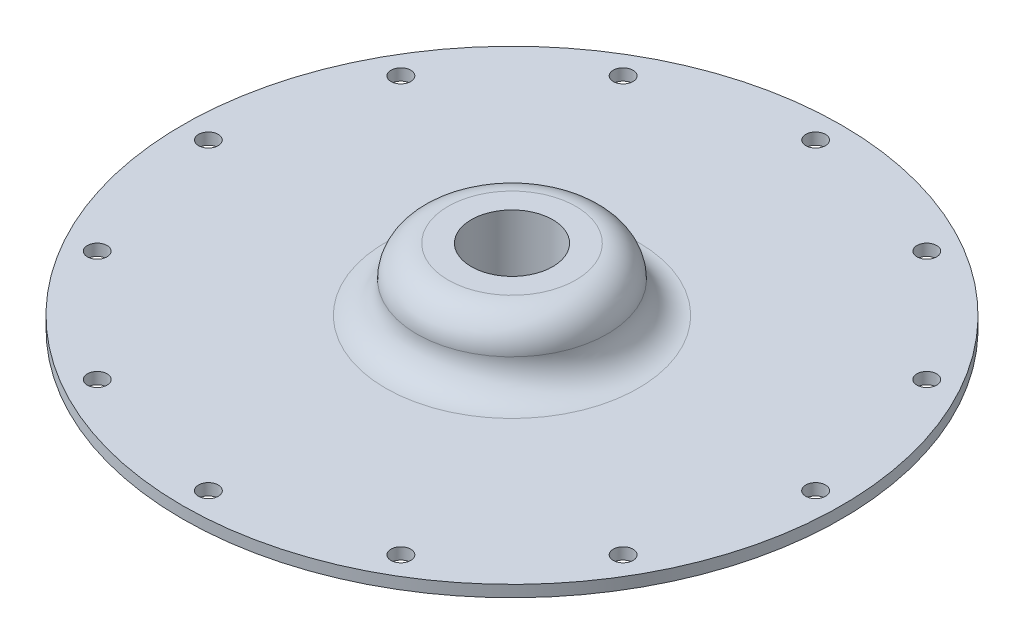
ISO-10303-21;
HEADER;
FILE_DESCRIPTION(('STEP AP214'),'2;1');
FILE_NAME('part.step','',(''),(''),'','','');
FILE_SCHEMA(('AUTOMOTIVE_DESIGN { 1 0 10303 214 1 1 1 1 }'));
ENDSEC;
DATA;
#1=APPLICATION_CONTEXT('core data for automotive mechanical design processes');
#2=APPLICATION_PROTOCOL_DEFINITION('international standard','automotive_design',2000,#1);
#3=PRODUCT_CONTEXT('',#1,'mechanical');
#4=PRODUCT('Part','Part','',(#3));
#5=PRODUCT_RELATED_PRODUCT_CATEGORY('part','',(#4));
#6=PRODUCT_DEFINITION_FORMATION('','',#4);
#7=PRODUCT_DEFINITION_CONTEXT('part definition',#1,'design');
#8=PRODUCT_DEFINITION('design','',#6,#7);
#9=PRODUCT_DEFINITION_SHAPE('','',#8);
#10=(LENGTH_UNIT() NAMED_UNIT(*) SI_UNIT(.MILLI.,.METRE.));
#11=(NAMED_UNIT(*) PLANE_ANGLE_UNIT() SI_UNIT($,.RADIAN.));
#12=(NAMED_UNIT(*) SI_UNIT($,.STERADIAN.) SOLID_ANGLE_UNIT());
#13=UNCERTAINTY_MEASURE_WITH_UNIT(LENGTH_MEASURE(1.E-05),#10,'distance_accuracy_value','');
#14=(GEOMETRIC_REPRESENTATION_CONTEXT(3) GLOBAL_UNCERTAINTY_ASSIGNED_CONTEXT((#13)) GLOBAL_UNIT_ASSIGNED_CONTEXT((#10,
#11,#12)) REPRESENTATION_CONTEXT('',''));
#15=CARTESIAN_POINT('',(0.,0.,0.));
#16=DIRECTION('',(0.,0.,1.));
#17=DIRECTION('',(1.,0.,0.));
#18=AXIS2_PLACEMENT_3D('',#15,#16,#17);
#19=CARTESIAN_POINT('',(0.,55.,0.));
#20=DIRECTION('',(0.,1.,0.));
#21=DIRECTION('',(0.,0.,1.));
#22=AXIS2_PLACEMENT_3D('',#19,#20,#21);
#23=CYLINDRICAL_SURFACE('',#22,45.212);
#24=CARTESIAN_POINT('',(0.,0.,0.));
#25=DIRECTION('',(0.,1.,0.));
#26=DIRECTION('',(0.,0.,1.));
#27=AXIS2_PLACEMENT_3D('',#24,#25,#26);
#28=CIRCLE('',#27,45.212);
#29=CARTESIAN_POINT('',(0.,0.,45.212));
#30=VERTEX_POINT('',#29);
#31=EDGE_CURVE('E10',#30,#30,#28,.T.);
#32=ORIENTED_EDGE('',*,*,#31,.T.);
#33=EDGE_LOOP('',(#32));
#34=FACE_BOUND('',#33,.T.);
#35=CARTESIAN_POINT('',(0.,1.5875,0.));
#36=DIRECTION('',(0.,1.,0.));
#37=DIRECTION('',(0.,0.,1.));
#38=AXIS2_PLACEMENT_3D('',#35,#36,#37);
#39=CIRCLE('',#38,45.212);
#40=CARTESIAN_POINT('',(0.,1.5875,45.212));
#41=VERTEX_POINT('',#40);
#42=EDGE_CURVE('E55',#41,#41,#39,.T.);
#43=ORIENTED_EDGE('',*,*,#42,.F.);
#44=EDGE_LOOP('',(#43));
#45=FACE_BOUND('',#44,.T.);
#46=ADVANCED_FACE('F30',(#34,#45),#23,.T.);
#47=CARTESIAN_POINT('',(-45.212,0.,0.));
#48=DIRECTION('',(0.,-1.,0.));
#49=DIRECTION('',(0.,0.,-1.));
#50=AXIS2_PLACEMENT_3D('',#47,#48,#49);
#51=PLANE('',#50);
#52=CARTESIAN_POINT('',(-36.0751542200448,0.,20.8279999999995));
#53=DIRECTION('',(0.,-1.,0.));
#54=DIRECTION('',(0.,0.,-1.));
#55=AXIS2_PLACEMENT_3D('',#52,#53,#54);
#56=CIRCLE('',#55,1.35254999999999);
#57=CARTESIAN_POINT('',(-36.0751542200448,0.,19.4754499999996));
#58=VERTEX_POINT('',#57);
#59=EDGE_CURVE('E124',#58,#58,#56,.T.);
#60=ORIENTED_EDGE('',*,*,#59,.F.);
#61=EDGE_LOOP('',(#60));
#62=FACE_BOUND('',#61,.T.);
#63=CARTESIAN_POINT('',(-20.8280000000004,0.,36.0751542200443));
#64=DIRECTION('',(0.,-1.,0.));
#65=DIRECTION('',(0.,0.,-1.));
#66=AXIS2_PLACEMENT_3D('',#63,#64,#65);
#67=CIRCLE('',#66,1.35254999999999);
#68=CARTESIAN_POINT('',(-20.8280000000004,0.,34.7226042200443));
#69=VERTEX_POINT('',#68);
#70=EDGE_CURVE('E118',#69,#69,#67,.T.);
#71=ORIENTED_EDGE('',*,*,#70,.F.);
#72=EDGE_LOOP('',(#71));
#73=FACE_BOUND('',#72,.T.);
#74=CARTESIAN_POINT('',(-4.3122205124602E-13,0.,41.656));
#75=DIRECTION('',(0.,-1.,0.));
#76=DIRECTION('',(0.,0.,-1.));
#77=AXIS2_PLACEMENT_3D('',#74,#75,#76);
#78=CIRCLE('',#77,1.35254999999999);
#79=CARTESIAN_POINT('',(-4.3122205124602E-13,0.,40.30345));
#80=VERTEX_POINT('',#79);
#81=EDGE_CURVE('E112',#80,#80,#78,.T.);
#82=ORIENTED_EDGE('',*,*,#81,.F.);
#83=EDGE_LOOP('',(#82));
#84=FACE_BOUND('',#83,.T.);
#85=CARTESIAN_POINT('',(20.8279999999997,0.,36.0751542200448));
#86=DIRECTION('',(0.,-1.,0.));
#87=DIRECTION('',(0.,0.,-1.));
#88=AXIS2_PLACEMENT_3D('',#85,#86,#87);
#89=CIRCLE('',#88,1.35254999999999);
#90=CARTESIAN_POINT('',(20.8279999999997,0.,34.7226042200448));
#91=VERTEX_POINT('',#90);
#92=EDGE_CURVE('E106',#91,#91,#89,.T.);
#93=ORIENTED_EDGE('',*,*,#92,.F.);
#94=EDGE_LOOP('',(#93));
#95=FACE_BOUND('',#94,.T.);
#96=CARTESIAN_POINT('',(36.0751542200444,0.,20.8280000000003));
#97=DIRECTION('',(0.,-1.,0.));
#98=DIRECTION('',(0.,0.,-1.));
#99=AXIS2_PLACEMENT_3D('',#96,#97,#98);
#100=CIRCLE('',#99,1.35254999999999);
#101=CARTESIAN_POINT('',(36.0751542200444,0.,19.4754500000003));
#102=VERTEX_POINT('',#101);
#103=EDGE_CURVE('E100',#102,#102,#100,.T.);
#104=ORIENTED_EDGE('',*,*,#103,.F.);
#105=EDGE_LOOP('',(#104));
#106=FACE_BOUND('',#105,.T.);
#107=CARTESIAN_POINT('',(41.656,0.,0.));
#108=DIRECTION('',(0.,-1.,0.));
#109=DIRECTION('',(0.,0.,-1.));
#110=AXIS2_PLACEMENT_3D('',#107,#108,#109);
#111=CIRCLE('',#110,1.35254999999999);
#112=CARTESIAN_POINT('',(41.656,0.,-1.35254999999999));
#113=VERTEX_POINT('',#112);
#114=EDGE_CURVE('E94',#113,#113,#111,.T.);
#115=ORIENTED_EDGE('',*,*,#114,.F.);
#116=EDGE_LOOP('',(#115));
#117=FACE_BOUND('',#116,.T.);
#118=CARTESIAN_POINT('',(36.0751542200447,0.,-20.8279999999998));
#119=DIRECTION('',(0.,-1.,0.));
#120=DIRECTION('',(0.,0.,-1.));
#121=AXIS2_PLACEMENT_3D('',#118,#119,#120);
#122=CIRCLE('',#121,1.35254999999999);
#123=CARTESIAN_POINT('',(36.0751542200447,0.,-22.1805499999998));
#124=VERTEX_POINT('',#123);
#125=EDGE_CURVE('E88',#124,#124,#122,.T.);
#126=ORIENTED_EDGE('',*,*,#125,.F.);
#127=EDGE_LOOP('',(#126));
#128=FACE_BOUND('',#127,.T.);
#129=CARTESIAN_POINT('',(20.8280000000002,0.,-36.0751542200445));
#130=DIRECTION('',(0.,-1.,0.));
#131=DIRECTION('',(0.,0.,-1.));
#132=AXIS2_PLACEMENT_3D('',#129,#130,#131);
#133=CIRCLE('',#132,1.35254999999999);
#134=CARTESIAN_POINT('',(20.8280000000002,0.,-37.4277042200445));
#135=VERTEX_POINT('',#134);
#136=EDGE_CURVE('E82',#135,#135,#133,.T.);
#137=ORIENTED_EDGE('',*,*,#136,.F.);
#138=EDGE_LOOP('',(#137));
#139=FACE_BOUND('',#138,.T.);
#140=CARTESIAN_POINT('',(1.40339757944321E-13,0.,-41.656));
#141=DIRECTION('',(0.,-1.,0.));
#142=DIRECTION('',(0.,0.,-1.));
#143=AXIS2_PLACEMENT_3D('',#140,#141,#142);
#144=CIRCLE('',#143,1.35254999999999);
#145=CARTESIAN_POINT('',(1.40339757944321E-13,0.,-43.00855));
#146=VERTEX_POINT('',#145);
#147=EDGE_CURVE('E76',#146,#146,#144,.T.);
#148=ORIENTED_EDGE('',*,*,#147,.F.);
#149=EDGE_LOOP('',(#148));
#150=FACE_BOUND('',#149,.T.);
#151=CARTESIAN_POINT('',(-20.8279999999999,0.,-36.0751542200446));
#152=DIRECTION('',(0.,-1.,0.));
#153=DIRECTION('',(0.,0.,-1.));
#154=AXIS2_PLACEMENT_3D('',#151,#152,#153);
#155=CIRCLE('',#154,1.35254999999999);
#156=CARTESIAN_POINT('',(-20.8279999999999,0.,-37.4277042200446));
#157=VERTEX_POINT('',#156);
#158=EDGE_CURVE('E70',#157,#157,#155,.T.);
#159=ORIENTED_EDGE('',*,*,#158,.F.);
#160=EDGE_LOOP('',(#159));
#161=FACE_BOUND('',#160,.T.);
#162=CARTESIAN_POINT('',(-36.0751542200446,0.,-20.828));
#163=DIRECTION('',(0.,-1.,0.));
#164=DIRECTION('',(0.,0.,-1.));
#165=AXIS2_PLACEMENT_3D('',#162,#163,#164);
#166=CIRCLE('',#165,1.35254999999999);
#167=CARTESIAN_POINT('',(-36.0751542200446,0.,-22.18055));
#168=VERTEX_POINT('',#167);
#169=EDGE_CURVE('E67',#168,#168,#166,.T.);
#170=ORIENTED_EDGE('',*,*,#169,.F.);
#171=EDGE_LOOP('',(#170));
#172=FACE_BOUND('',#171,.T.);
#173=CARTESIAN_POINT('',(-41.656,0.,0.));
#174=DIRECTION('',(0.,-1.,0.));
#175=DIRECTION('',(0.,0.,-1.));
#176=AXIS2_PLACEMENT_3D('',#173,#174,#175);
#177=CIRCLE('',#176,1.35254999999999);
#178=CARTESIAN_POINT('',(-41.656,0.,-1.35254999999998));
#179=VERTEX_POINT('',#178);
#180=EDGE_CURVE('E61',#179,#179,#177,.T.);
#181=ORIENTED_EDGE('',*,*,#180,.F.);
#182=EDGE_LOOP('',(#181));
#183=FACE_BOUND('',#182,.T.);
#184=CARTESIAN_POINT('',(0.,0.,0.));
#185=DIRECTION('',(0.,1.,0.));
#186=DIRECTION('',(0.,0.,1.));
#187=AXIS2_PLACEMENT_3D('',#184,#185,#186);
#188=CIRCLE('',#187,5.588);
#189=CARTESIAN_POINT('',(0.,0.,5.588));
#190=VERTEX_POINT('',#189);
#191=EDGE_CURVE('E37',#190,#190,#188,.T.);
#192=ORIENTED_EDGE('',*,*,#191,.T.);
#193=EDGE_LOOP('',(#192));
#194=FACE_BOUND('',#193,.T.);
#195=ORIENTED_EDGE('',*,*,#31,.F.);
#196=EDGE_LOOP('',(#195));
#197=FACE_BOUND('',#196,.T.);
#198=ADVANCED_FACE('F130',(#62,#73,#84,#95,#106,#117,#128,#139,#150,#161,#172,#183,#194,#197),
#51,.T.);
#199=CARTESIAN_POINT('',(0.,55.,0.));
#200=DIRECTION('',(0.,1.,0.));
#201=DIRECTION('',(0.,0.,1.));
#202=AXIS2_PLACEMENT_3D('',#199,#200,#201);
#203=CYLINDRICAL_SURFACE('',#202,5.588);
#204=CARTESIAN_POINT('',(0.,10.16,0.));
#205=DIRECTION('',(0.,1.,0.));
#206=DIRECTION('',(0.,0.,1.));
#207=AXIS2_PLACEMENT_3D('',#204,#205,#206);
#208=CIRCLE('',#207,5.588);
#209=CARTESIAN_POINT('',(0.,10.16,5.588));
#210=VERTEX_POINT('',#209);
#211=EDGE_CURVE('E41',#210,#210,#208,.T.);
#212=ORIENTED_EDGE('',*,*,#211,.T.);
#213=EDGE_LOOP('',(#212));
#214=FACE_BOUND('',#213,.T.);
#215=ORIENTED_EDGE('',*,*,#191,.F.);
#216=EDGE_LOOP('',(#215));
#217=FACE_BOUND('',#216,.T.);
#218=ADVANCED_FACE('F133',(#214,#217),#203,.F.);
#219=CARTESIAN_POINT('',(-5.588,10.16,0.));
#220=DIRECTION('',(0.,1.,0.));
#221=DIRECTION('',(0.,0.,1.));
#222=AXIS2_PLACEMENT_3D('',#219,#220,#221);
#223=PLANE('',#222);
#224=CARTESIAN_POINT('',(0.,10.16,0.));
#225=DIRECTION('',(0.,1.,0.));
#226=DIRECTION('',(0.,0.,1.));
#227=AXIS2_PLACEMENT_3D('',#224,#225,#226);
#228=CIRCLE('',#227,8.763);
#229=CARTESIAN_POINT('',(0.,10.16,8.763));
#230=VERTEX_POINT('',#229);
#231=EDGE_CURVE('E46',#230,#230,#228,.T.);
#232=ORIENTED_EDGE('',*,*,#231,.T.);
#233=EDGE_LOOP('',(#232));
#234=FACE_BOUND('',#233,.T.);
#235=ORIENTED_EDGE('',*,*,#211,.F.);
#236=EDGE_LOOP('',(#235));
#237=FACE_BOUND('',#236,.T.);
#238=ADVANCED_FACE('F160',(#234,#237),#223,.T.);
#239=CARTESIAN_POINT('',(0.,5.87375,0.));
#240=DIRECTION('',(0.,1.,0.));
#241=DIRECTION('',(0.,0.,1.));
#242=AXIS2_PLACEMENT_3D('',#239,#240,#241);
#243=TOROIDAL_SURFACE('',#242,8.763,4.28625);
#244=CARTESIAN_POINT('',(0.,5.87375,0.));
#245=DIRECTION('',(0.,1.,0.));
#246=DIRECTION('',(0.,0.,1.));
#247=AXIS2_PLACEMENT_3D('',#244,#245,#246);
#248=CIRCLE('',#247,13.04925);
#249=CARTESIAN_POINT('',(0.,5.87375,13.04925));
#250=VERTEX_POINT('',#249);
#251=EDGE_CURVE('E49',#250,#250,#248,.T.);
#252=ORIENTED_EDGE('',*,*,#251,.T.);
#253=EDGE_LOOP('',(#252));
#254=FACE_BOUND('',#253,.T.);
#255=ORIENTED_EDGE('',*,*,#231,.F.);
#256=EDGE_LOOP('',(#255));
#257=FACE_BOUND('',#256,.T.);
#258=ADVANCED_FACE('F166',(#254,#257),#243,.T.);
#259=CARTESIAN_POINT('',(0.,5.87375,0.));
#260=DIRECTION('',(0.,1.,0.));
#261=DIRECTION('',(0.,0.,1.));
#262=AXIS2_PLACEMENT_3D('',#259,#260,#261);
#263=TOROIDAL_SURFACE('',#262,17.3355,4.28625);
#264=CARTESIAN_POINT('',(0.,1.5875,0.));
#265=DIRECTION('',(0.,1.,0.));
#266=DIRECTION('',(0.,0.,1.));
#267=AXIS2_PLACEMENT_3D('',#264,#265,#266);
#268=CIRCLE('',#267,17.3355);
#269=CARTESIAN_POINT('',(0.,1.5875,17.3355));
#270=VERTEX_POINT('',#269);
#271=EDGE_CURVE('E52',#270,#270,#268,.T.);
#272=ORIENTED_EDGE('',*,*,#271,.T.);
#273=EDGE_LOOP('',(#272));
#274=FACE_BOUND('',#273,.T.);
#275=ORIENTED_EDGE('',*,*,#251,.F.);
#276=EDGE_LOOP('',(#275));
#277=FACE_BOUND('',#276,.T.);
#278=ADVANCED_FACE('F179',(#274,#277),#263,.F.);
#279=CARTESIAN_POINT('',(-45.212,1.5875,0.));
#280=DIRECTION('',(0.,1.,0.));
#281=DIRECTION('',(0.,0.,1.));
#282=AXIS2_PLACEMENT_3D('',#279,#280,#281);
#283=PLANE('',#282);
#284=CARTESIAN_POINT('',(-36.0751542200448,1.5875,20.8279999999995));
#285=DIRECTION('',(0.,1.,0.));
#286=DIRECTION('',(0.,0.,1.));
#287=AXIS2_PLACEMENT_3D('',#284,#285,#286);
#288=CIRCLE('',#287,1.35254999999999);
#289=CARTESIAN_POINT('',(-36.0751542200448,1.5875,22.1805499999995));
#290=VERTEX_POINT('',#289);
#291=EDGE_CURVE('E121',#290,#290,#288,.T.);
#292=ORIENTED_EDGE('',*,*,#291,.F.);
#293=EDGE_LOOP('',(#292));
#294=FACE_BOUND('',#293,.T.);
#295=CARTESIAN_POINT('',(-20.8280000000004,1.5875,36.0751542200443));
#296=DIRECTION('',(0.,1.,0.));
#297=DIRECTION('',(0.,0.,1.));
#298=AXIS2_PLACEMENT_3D('',#295,#296,#297);
#299=CIRCLE('',#298,1.35254999999999);
#300=CARTESIAN_POINT('',(-20.8280000000004,1.5875,37.4277042200443));
#301=VERTEX_POINT('',#300);
#302=EDGE_CURVE('E115',#301,#301,#299,.T.);
#303=ORIENTED_EDGE('',*,*,#302,.F.);
#304=EDGE_LOOP('',(#303));
#305=FACE_BOUND('',#304,.T.);
#306=CARTESIAN_POINT('',(-4.3122205124602E-13,1.5875,41.656));
#307=DIRECTION('',(0.,1.,0.));
#308=DIRECTION('',(0.,0.,1.));
#309=AXIS2_PLACEMENT_3D('',#306,#307,#308);
#310=CIRCLE('',#309,1.35254999999999);
#311=CARTESIAN_POINT('',(-4.3122205124602E-13,1.5875,43.00855));
#312=VERTEX_POINT('',#311);
#313=EDGE_CURVE('E109',#312,#312,#310,.T.);
#314=ORIENTED_EDGE('',*,*,#313,.F.);
#315=EDGE_LOOP('',(#314));
#316=FACE_BOUND('',#315,.T.);
#317=CARTESIAN_POINT('',(20.8279999999997,1.5875,36.0751542200448));
#318=DIRECTION('',(0.,1.,0.));
#319=DIRECTION('',(0.,0.,1.));
#320=AXIS2_PLACEMENT_3D('',#317,#318,#319);
#321=CIRCLE('',#320,1.35254999999999);
#322=CARTESIAN_POINT('',(20.8279999999997,1.5875,37.4277042200448));
#323=VERTEX_POINT('',#322);
#324=EDGE_CURVE('E103',#323,#323,#321,.T.);
#325=ORIENTED_EDGE('',*,*,#324,.F.);
#326=EDGE_LOOP('',(#325));
#327=FACE_BOUND('',#326,.T.);
#328=CARTESIAN_POINT('',(36.0751542200444,1.5875,20.8280000000003));
#329=DIRECTION('',(0.,1.,0.));
#330=DIRECTION('',(0.,0.,1.));
#331=AXIS2_PLACEMENT_3D('',#328,#329,#330);
#332=CIRCLE('',#331,1.35254999999999);
#333=CARTESIAN_POINT('',(36.0751542200444,1.5875,22.1805500000003));
#334=VERTEX_POINT('',#333);
#335=EDGE_CURVE('E97',#334,#334,#332,.T.);
#336=ORIENTED_EDGE('',*,*,#335,.F.);
#337=EDGE_LOOP('',(#336));
#338=FACE_BOUND('',#337,.T.);
#339=CARTESIAN_POINT('',(41.656,1.5875,0.));
#340=DIRECTION('',(0.,1.,0.));
#341=DIRECTION('',(0.,0.,1.));
#342=AXIS2_PLACEMENT_3D('',#339,#340,#341);
#343=CIRCLE('',#342,1.35254999999999);
#344=CARTESIAN_POINT('',(41.656,1.5875,1.35254999999999));
#345=VERTEX_POINT('',#344);
#346=EDGE_CURVE('E91',#345,#345,#343,.T.);
#347=ORIENTED_EDGE('',*,*,#346,.F.);
#348=EDGE_LOOP('',(#347));
#349=FACE_BOUND('',#348,.T.);
#350=CARTESIAN_POINT('',(36.0751542200447,1.5875,-20.8279999999998));
#351=DIRECTION('',(0.,1.,0.));
#352=DIRECTION('',(0.,0.,1.));
#353=AXIS2_PLACEMENT_3D('',#350,#351,#352);
#354=CIRCLE('',#353,1.35254999999999);
#355=CARTESIAN_POINT('',(36.0751542200447,1.5875,-19.4754499999998));
#356=VERTEX_POINT('',#355);
#357=EDGE_CURVE('E85',#356,#356,#354,.T.);
#358=ORIENTED_EDGE('',*,*,#357,.F.);
#359=EDGE_LOOP('',(#358));
#360=FACE_BOUND('',#359,.T.);
#361=CARTESIAN_POINT('',(20.8280000000002,1.5875,-36.0751542200445));
#362=DIRECTION('',(0.,1.,0.));
#363=DIRECTION('',(0.,0.,1.));
#364=AXIS2_PLACEMENT_3D('',#361,#362,#363);
#365=CIRCLE('',#364,1.35254999999999);
#366=CARTESIAN_POINT('',(20.8280000000002,1.5875,-34.7226042200445));
#367=VERTEX_POINT('',#366);
#368=EDGE_CURVE('E79',#367,#367,#365,.T.);
#369=ORIENTED_EDGE('',*,*,#368,.F.);
#370=EDGE_LOOP('',(#369));
#371=FACE_BOUND('',#370,.T.);
#372=CARTESIAN_POINT('',(1.40339757944321E-13,1.5875,-41.656));
#373=DIRECTION('',(0.,1.,0.));
#374=DIRECTION('',(0.,0.,1.));
#375=AXIS2_PLACEMENT_3D('',#372,#373,#374);
#376=CIRCLE('',#375,1.35254999999999);
#377=CARTESIAN_POINT('',(1.40339757944321E-13,1.5875,-40.30345));
#378=VERTEX_POINT('',#377);
#379=EDGE_CURVE('E73',#378,#378,#376,.T.);
#380=ORIENTED_EDGE('',*,*,#379,.F.);
#381=EDGE_LOOP('',(#380));
#382=FACE_BOUND('',#381,.T.);
#383=CARTESIAN_POINT('',(-20.8279999999999,1.5875,-36.0751542200446));
#384=DIRECTION('',(0.,1.,0.));
#385=DIRECTION('',(0.,0.,1.));
#386=AXIS2_PLACEMENT_3D('',#383,#384,#385);
#387=CIRCLE('',#386,1.35254999999999);
#388=CARTESIAN_POINT('',(-20.8279999999999,1.5875,-34.7226042200446));
#389=VERTEX_POINT('',#388);
#390=EDGE_CURVE('E33',#389,#389,#387,.T.);
#391=ORIENTED_EDGE('',*,*,#390,.F.);
#392=EDGE_LOOP('',(#391));
#393=FACE_BOUND('',#392,.T.);
#394=CARTESIAN_POINT('',(-36.0751542200446,1.5875,-20.828));
#395=DIRECTION('',(0.,1.,0.));
#396=DIRECTION('',(0.,0.,1.));
#397=AXIS2_PLACEMENT_3D('',#394,#395,#396);
#398=CIRCLE('',#397,1.35254999999999);
#399=CARTESIAN_POINT('',(-36.0751542200446,1.5875,-19.47545));
#400=VERTEX_POINT('',#399);
#401=EDGE_CURVE('E64',#400,#400,#398,.T.);
#402=ORIENTED_EDGE('',*,*,#401,.F.);
#403=EDGE_LOOP('',(#402));
#404=FACE_BOUND('',#403,.T.);
#405=CARTESIAN_POINT('',(-41.656,1.5875,0.));
#406=DIRECTION('',(0.,1.,0.));
#407=DIRECTION('',(0.,0.,1.));
#408=AXIS2_PLACEMENT_3D('',#405,#406,#407);
#409=CIRCLE('',#408,1.35254999999999);
#410=CARTESIAN_POINT('',(-41.656,1.5875,1.35255));
#411=VERTEX_POINT('',#410);
#412=EDGE_CURVE('E58',#411,#411,#409,.T.);
#413=ORIENTED_EDGE('',*,*,#412,.F.);
#414=EDGE_LOOP('',(#413));
#415=FACE_BOUND('',#414,.T.);
#416=ORIENTED_EDGE('',*,*,#42,.T.);
#417=EDGE_LOOP('',(#416));
#418=FACE_BOUND('',#417,.T.);
#419=ORIENTED_EDGE('',*,*,#271,.F.);
#420=EDGE_LOOP('',(#419));
#421=FACE_BOUND('',#420,.T.);
#422=ADVANCED_FACE('F175',(#294,#305,#316,#327,#338,#349,#360,#371,#382,#393,#404,#415,#418,
#421),#283,.T.);
#423=CARTESIAN_POINT('',(-41.656,0.,0.));
#424=DIRECTION('',(0.,-1.,0.));
#425=DIRECTION('',(0.,0.,-1.));
#426=AXIS2_PLACEMENT_3D('',#423,#424,#425);
#427=CYLINDRICAL_SURFACE('',#426,1.35254999999999);
#428=ORIENTED_EDGE('',*,*,#412,.T.);
#429=EDGE_LOOP('',(#428));
#430=FACE_BOUND('',#429,.T.);
#431=ORIENTED_EDGE('',*,*,#180,.T.);
#432=EDGE_LOOP('',(#431));
#433=FACE_BOUND('',#432,.T.);
#434=ADVANCED_FACE('F178',(#430,#433),#427,.F.);
#435=CARTESIAN_POINT('',(-36.0751542200446,0.,-20.828));
#436=DIRECTION('',(0.,-1.,0.));
#437=DIRECTION('',(0.,0.,-1.));
#438=AXIS2_PLACEMENT_3D('',#435,#436,#437);
#439=CYLINDRICAL_SURFACE('',#438,1.35254999999999);
#440=ORIENTED_EDGE('',*,*,#401,.T.);
#441=EDGE_LOOP('',(#440));
#442=FACE_BOUND('',#441,.T.);
#443=ORIENTED_EDGE('',*,*,#169,.T.);
#444=EDGE_LOOP('',(#443));
#445=FACE_BOUND('',#444,.T.);
#446=ADVANCED_FACE('F200',(#442,#445),#439,.F.);
#447=CARTESIAN_POINT('',(-20.8279999999999,0.,-36.0751542200446));
#448=DIRECTION('',(0.,-1.,0.));
#449=DIRECTION('',(0.,0.,-1.));
#450=AXIS2_PLACEMENT_3D('',#447,#448,#449);
#451=CYLINDRICAL_SURFACE('',#450,1.35254999999999);
#452=ORIENTED_EDGE('',*,*,#390,.T.);
#453=EDGE_LOOP('',(#452));
#454=FACE_BOUND('',#453,.T.);
#455=ORIENTED_EDGE('',*,*,#158,.T.);
#456=EDGE_LOOP('',(#455));
#457=FACE_BOUND('',#456,.T.);
#458=ADVANCED_FACE('F204',(#454,#457),#451,.F.);
#459=CARTESIAN_POINT('',(1.40339757944321E-13,0.,-41.656));
#460=DIRECTION('',(0.,-1.,0.));
#461=DIRECTION('',(0.,0.,-1.));
#462=AXIS2_PLACEMENT_3D('',#459,#460,#461);
#463=CYLINDRICAL_SURFACE('',#462,1.35254999999999);
#464=ORIENTED_EDGE('',*,*,#379,.T.);
#465=EDGE_LOOP('',(#464));
#466=FACE_BOUND('',#465,.T.);
#467=ORIENTED_EDGE('',*,*,#147,.T.);
#468=EDGE_LOOP('',(#467));
#469=FACE_BOUND('',#468,.T.);
#470=ADVANCED_FACE('F208',(#466,#469),#463,.F.);
#471=CARTESIAN_POINT('',(20.8280000000002,0.,-36.0751542200445));
#472=DIRECTION('',(0.,-1.,0.));
#473=DIRECTION('',(0.,0.,-1.));
#474=AXIS2_PLACEMENT_3D('',#471,#472,#473);
#475=CYLINDRICAL_SURFACE('',#474,1.35254999999999);
#476=ORIENTED_EDGE('',*,*,#368,.T.);
#477=EDGE_LOOP('',(#476));
#478=FACE_BOUND('',#477,.T.);
#479=ORIENTED_EDGE('',*,*,#136,.T.);
#480=EDGE_LOOP('',(#479));
#481=FACE_BOUND('',#480,.T.);
#482=ADVANCED_FACE('F212',(#478,#481),#475,.F.);
#483=CARTESIAN_POINT('',(36.0751542200447,0.,-20.8279999999998));
#484=DIRECTION('',(0.,-1.,0.));
#485=DIRECTION('',(0.,0.,-1.));
#486=AXIS2_PLACEMENT_3D('',#483,#484,#485);
#487=CYLINDRICAL_SURFACE('',#486,1.35254999999999);
#488=ORIENTED_EDGE('',*,*,#357,.T.);
#489=EDGE_LOOP('',(#488));
#490=FACE_BOUND('',#489,.T.);
#491=ORIENTED_EDGE('',*,*,#125,.T.);
#492=EDGE_LOOP('',(#491));
#493=FACE_BOUND('',#492,.T.);
#494=ADVANCED_FACE('F216',(#490,#493),#487,.F.);
#495=CARTESIAN_POINT('',(41.656,0.,0.));
#496=DIRECTION('',(0.,-1.,0.));
#497=DIRECTION('',(0.,0.,-1.));
#498=AXIS2_PLACEMENT_3D('',#495,#496,#497);
#499=CYLINDRICAL_SURFACE('',#498,1.35254999999999);
#500=ORIENTED_EDGE('',*,*,#346,.T.);
#501=EDGE_LOOP('',(#500));
#502=FACE_BOUND('',#501,.T.);
#503=ORIENTED_EDGE('',*,*,#114,.T.);
#504=EDGE_LOOP('',(#503));
#505=FACE_BOUND('',#504,.T.);
#506=ADVANCED_FACE('F220',(#502,#505),#499,.F.);
#507=CARTESIAN_POINT('',(36.0751542200444,0.,20.8280000000003));
#508=DIRECTION('',(0.,-1.,0.));
#509=DIRECTION('',(0.,0.,-1.));
#510=AXIS2_PLACEMENT_3D('',#507,#508,#509);
#511=CYLINDRICAL_SURFACE('',#510,1.35254999999999);
#512=ORIENTED_EDGE('',*,*,#335,.T.);
#513=EDGE_LOOP('',(#512));
#514=FACE_BOUND('',#513,.T.);
#515=ORIENTED_EDGE('',*,*,#103,.T.);
#516=EDGE_LOOP('',(#515));
#517=FACE_BOUND('',#516,.T.);
#518=ADVANCED_FACE('F224',(#514,#517),#511,.F.);
#519=CARTESIAN_POINT('',(20.8279999999997,0.,36.0751542200448));
#520=DIRECTION('',(0.,-1.,0.));
#521=DIRECTION('',(0.,0.,-1.));
#522=AXIS2_PLACEMENT_3D('',#519,#520,#521);
#523=CYLINDRICAL_SURFACE('',#522,1.35254999999999);
#524=ORIENTED_EDGE('',*,*,#324,.T.);
#525=EDGE_LOOP('',(#524));
#526=FACE_BOUND('',#525,.T.);
#527=ORIENTED_EDGE('',*,*,#92,.T.);
#528=EDGE_LOOP('',(#527));
#529=FACE_BOUND('',#528,.T.);
#530=ADVANCED_FACE('F228',(#526,#529),#523,.F.);
#531=CARTESIAN_POINT('',(-4.3122205124602E-13,0.,41.656));
#532=DIRECTION('',(0.,-1.,0.));
#533=DIRECTION('',(0.,0.,-1.));
#534=AXIS2_PLACEMENT_3D('',#531,#532,#533);
#535=CYLINDRICAL_SURFACE('',#534,1.35254999999999);
#536=ORIENTED_EDGE('',*,*,#313,.T.);
#537=EDGE_LOOP('',(#536));
#538=FACE_BOUND('',#537,.T.);
#539=ORIENTED_EDGE('',*,*,#81,.T.);
#540=EDGE_LOOP('',(#539));
#541=FACE_BOUND('',#540,.T.);
#542=ADVANCED_FACE('F232',(#538,#541),#535,.F.);
#543=CARTESIAN_POINT('',(-20.8280000000004,0.,36.0751542200443));
#544=DIRECTION('',(0.,-1.,0.));
#545=DIRECTION('',(0.,0.,-1.));
#546=AXIS2_PLACEMENT_3D('',#543,#544,#545);
#547=CYLINDRICAL_SURFACE('',#546,1.35254999999999);
#548=ORIENTED_EDGE('',*,*,#302,.T.);
#549=EDGE_LOOP('',(#548));
#550=FACE_BOUND('',#549,.T.);
#551=ORIENTED_EDGE('',*,*,#70,.T.);
#552=EDGE_LOOP('',(#551));
#553=FACE_BOUND('',#552,.T.);
#554=ADVANCED_FACE('F236',(#550,#553),#547,.F.);
#555=CARTESIAN_POINT('',(-36.0751542200448,0.,20.8279999999995));
#556=DIRECTION('',(0.,-1.,0.));
#557=DIRECTION('',(0.,0.,-1.));
#558=AXIS2_PLACEMENT_3D('',#555,#556,#557);
#559=CYLINDRICAL_SURFACE('',#558,1.35254999999999);
#560=ORIENTED_EDGE('',*,*,#291,.T.);
#561=EDGE_LOOP('',(#560));
#562=FACE_BOUND('',#561,.T.);
#563=ORIENTED_EDGE('',*,*,#59,.T.);
#564=EDGE_LOOP('',(#563));
#565=FACE_BOUND('',#564,.T.);
#566=ADVANCED_FACE('F128',(#562,#565),#559,.F.);
#567=CLOSED_SHELL('',(#46,#198,#218,#238,#258,#278,#422,#434,#446,#458,#470,#482,#494,#506,#518,
#530,#542,#554,#566));
#568=MANIFOLD_SOLID_BREP('B2',#567);
#569=ADVANCED_BREP_SHAPE_REPRESENTATION('',(#18,#568),#14);
#570=SHAPE_DEFINITION_REPRESENTATION(#9,#569);
ENDSEC;
END-ISO-10303-21;
